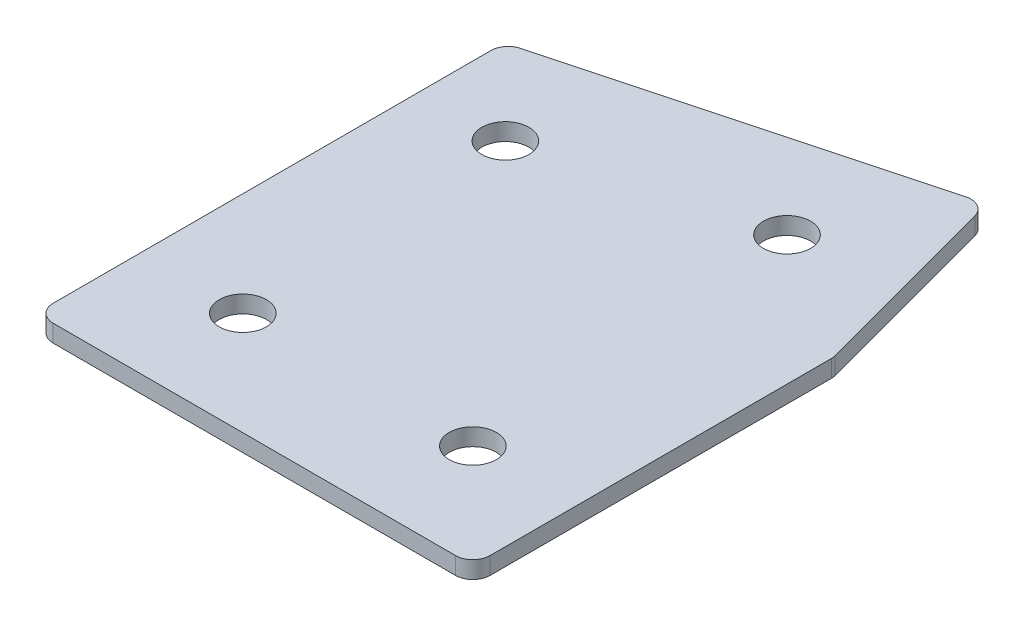
ISO-10303-21;
HEADER;
FILE_DESCRIPTION(('STEP AP214'),'2;1');
FILE_NAME('part.step','',(''),(''),'','','');
FILE_SCHEMA(('AUTOMOTIVE_DESIGN { 1 0 10303 214 1 1 1 1 }'));
ENDSEC;
DATA;
#1=APPLICATION_CONTEXT('core data for automotive mechanical design processes');
#2=APPLICATION_PROTOCOL_DEFINITION('international standard','automotive_design',2000,#1);
#3=PRODUCT_CONTEXT('',#1,'mechanical');
#4=PRODUCT('Part','Part','',(#3));
#5=PRODUCT_RELATED_PRODUCT_CATEGORY('part','',(#4));
#6=PRODUCT_DEFINITION_FORMATION('','',#4);
#7=PRODUCT_DEFINITION_CONTEXT('part definition',#1,'design');
#8=PRODUCT_DEFINITION('design','',#6,#7);
#9=PRODUCT_DEFINITION_SHAPE('','',#8);
#10=(LENGTH_UNIT() NAMED_UNIT(*) SI_UNIT(.MILLI.,.METRE.));
#11=(NAMED_UNIT(*) PLANE_ANGLE_UNIT() SI_UNIT($,.RADIAN.));
#12=(NAMED_UNIT(*) SI_UNIT($,.STERADIAN.) SOLID_ANGLE_UNIT());
#13=UNCERTAINTY_MEASURE_WITH_UNIT(LENGTH_MEASURE(1.E-05),#10,'distance_accuracy_value','');
#14=(GEOMETRIC_REPRESENTATION_CONTEXT(3) GLOBAL_UNCERTAINTY_ASSIGNED_CONTEXT((#13)) GLOBAL_UNIT_ASSIGNED_CONTEXT((#10,
#11,#12)) REPRESENTATION_CONTEXT('',''));
#15=CARTESIAN_POINT('',(0.,0.,0.));
#16=DIRECTION('',(0.,0.,1.));
#17=DIRECTION('',(1.,0.,0.));
#18=AXIS2_PLACEMENT_3D('',#15,#16,#17);
#19=CARTESIAN_POINT('',(0.,0.,0.));
#20=DIRECTION('',(0.,1.,0.));
#21=DIRECTION('',(0.,0.,1.));
#22=AXIS2_PLACEMENT_3D('',#19,#20,#21);
#23=PLANE('',#22);
#24=CARTESIAN_POINT('',(80.,0.,0.));
#25=DIRECTION('',(0.,1.,0.));
#26=DIRECTION('',(0.,0.,1.));
#27=AXIS2_PLACEMENT_3D('',#24,#25,#26);
#28=CIRCLE('',#27,4.09999999999999);
#29=CARTESIAN_POINT('',(80.,0.,4.09999999999999));
#30=VERTEX_POINT('',#29);
#31=EDGE_CURVE('E201',#30,#30,#28,.T.);
#32=ORIENTED_EDGE('',*,*,#31,.T.);
#33=EDGE_LOOP('',(#32));
#34=FACE_BOUND('',#33,.T.);
#35=CARTESIAN_POINT('',(75.5051025721683,0.,-59.1421356237311));
#36=DIRECTION('',(0.,1.,0.));
#37=DIRECTION('',(0.,0.,1.));
#38=AXIS2_PLACEMENT_3D('',#35,#36,#37);
#39=CIRCLE('',#38,4.1);
#40=CARTESIAN_POINT('',(75.5051025721683,0.,-55.0421356237311));
#41=VERTEX_POINT('',#40);
#42=EDGE_CURVE('E195',#41,#41,#39,.T.);
#43=ORIENTED_EDGE('',*,*,#42,.T.);
#44=EDGE_LOOP('',(#43));
#45=FACE_BOUND('',#44,.T.);
#46=CARTESIAN_POINT('',(36.8680695206055,0.,-48.7893738196305));
#47=DIRECTION('',(0.,1.,0.));
#48=DIRECTION('',(0.,0.,1.));
#49=AXIS2_PLACEMENT_3D('',#46,#47,#48);
#50=CIRCLE('',#49,4.1);
#51=CARTESIAN_POINT('',(36.8680695206055,0.,-44.6893738196305));
#52=VERTEX_POINT('',#51);
#53=EDGE_CURVE('E189',#52,#52,#50,.T.);
#54=ORIENTED_EDGE('',*,*,#53,.T.);
#55=EDGE_LOOP('',(#54));
#56=FACE_BOUND('',#55,.T.);
#57=CARTESIAN_POINT('',(40.,0.,0.));
#58=DIRECTION('',(0.,1.,0.));
#59=DIRECTION('',(0.,0.,1.));
#60=AXIS2_PLACEMENT_3D('',#57,#58,#59);
#61=CIRCLE('',#60,4.1);
#62=CARTESIAN_POINT('',(40.,0.,4.10000000000001));
#63=VERTEX_POINT('',#62);
#64=EDGE_CURVE('E115',#63,#63,#61,.T.);
#65=ORIENTED_EDGE('',*,*,#64,.T.);
#66=EDGE_LOOP('',(#65));
#67=FACE_BOUND('',#66,.T.);
#68=DIRECTION('',(0.,0.,1.));
#69=VECTOR('',#68,1.);
#70=CARTESIAN_POINT('',(22.0000000000001,0.,-63.440457845956));
#71=LINE('',#70,#69);
#72=CARTESIAN_POINT('',(22.0000000000001,0.,-61.1384768820191));
#73=VERTEX_POINT('',#72);
#74=CARTESIAN_POINT('',(22.,0.,14.9999999999999));
#75=VERTEX_POINT('',#74);
#76=EDGE_CURVE('E182',#73,#75,#71,.T.);
#77=ORIENTED_EDGE('',*,*,#76,.F.);
#78=CARTESIAN_POINT('',(25.0000000000001,0.,-61.1384768820191));
#79=DIRECTION('',(0.,1.,0.));
#80=DIRECTION('',(0.,0.,1.));
#81=AXIS2_PLACEMENT_3D('',#78,#79,#80);
#82=CIRCLE('',#81,3.);
#83=CARTESIAN_POINT('',(24.2235428646926,0.,-64.0362543608864));
#84=VERTEX_POINT('',#83);
#85=EDGE_CURVE('E146',#73,#84,#82,.F.);
#86=ORIENTED_EDGE('',*,*,#85,.T.);
#87=DIRECTION('',(-0.96592582628907,0.,0.258819045102515));
#88=VECTOR('',#87,1.);
#89=CARTESIAN_POINT('',(88.2330246335262,0.,-81.1875433087796));
#90=LINE('',#89,#88);
#91=CARTESIAN_POINT('',(85.335247154659,0.,-80.411086173472));
#92=VERTEX_POINT('',#91);
#93=EDGE_CURVE('E174',#92,#84,#90,.T.);
#94=ORIENTED_EDGE('',*,*,#93,.F.);
#95=CARTESIAN_POINT('',(86.1117042899665,0.,-77.5133086946048));
#96=DIRECTION('',(0.,1.,0.));
#97=DIRECTION('',(0.,0.,1.));
#98=AXIS2_PLACEMENT_3D('',#95,#96,#97);
#99=CIRCLE('',#98,3.);
#100=CARTESIAN_POINT('',(89.0094817688337,0.,-78.2897658299124));
#101=VERTEX_POINT('',#100);
#102=EDGE_CURVE('E118',#92,#101,#99,.F.);
#103=ORIENTED_EDGE('',*,*,#102,.T.);
#104=DIRECTION('',(-0.258819045102522,0.,-0.965925826289068));
#105=VECTOR('',#104,1.);
#106=CARTESIAN_POINT('',(98.0000000000002,0.,-44.7366950048252));
#107=LINE('',#106,#105);
#108=CARTESIAN_POINT('',(97.8977774788674,0.,-45.1181946473706));
#109=VERTEX_POINT('',#108);
#110=EDGE_CURVE('E119',#109,#101,#107,.T.);
#111=ORIENTED_EDGE('',*,*,#110,.F.);
#112=CARTESIAN_POINT('',(95.0000000000002,0.,-44.341737512063));
#113=DIRECTION('',(0.,1.,0.));
#114=DIRECTION('',(0.,0.,1.));
#115=AXIS2_PLACEMENT_3D('',#112,#113,#114);
#116=CIRCLE('',#115,3.);
#117=CARTESIAN_POINT('',(98.0000000000002,0.,-44.341737512063));
#118=VERTEX_POINT('',#117);
#119=EDGE_CURVE('E141',#109,#118,#116,.F.);
#120=ORIENTED_EDGE('',*,*,#119,.T.);
#121=DIRECTION('',(0.,0.,-1.));
#122=VECTOR('',#121,1.);
#123=CARTESIAN_POINT('',(98.,0.,18.));
#124=LINE('',#123,#122);
#125=CARTESIAN_POINT('',(98.,0.,15.));
#126=VERTEX_POINT('',#125);
#127=EDGE_CURVE('E123',#126,#118,#124,.T.);
#128=ORIENTED_EDGE('',*,*,#127,.F.);
#129=CARTESIAN_POINT('',(95.,0.,15.));
#130=DIRECTION('',(0.,1.,0.));
#131=DIRECTION('',(0.,0.,1.));
#132=AXIS2_PLACEMENT_3D('',#129,#130,#131);
#133=CIRCLE('',#132,3.);
#134=CARTESIAN_POINT('',(95.,0.,18.));
#135=VERTEX_POINT('',#134);
#136=EDGE_CURVE('E31',#126,#135,#133,.F.);
#137=ORIENTED_EDGE('',*,*,#136,.T.);
#138=DIRECTION('',(1.,0.,0.));
#139=VECTOR('',#138,1.);
#140=CARTESIAN_POINT('',(22.,0.,18.));
#141=LINE('',#140,#139);
#142=CARTESIAN_POINT('',(25.,0.,18.));
#143=VERTEX_POINT('',#142);
#144=EDGE_CURVE('E180',#143,#135,#141,.T.);
#145=ORIENTED_EDGE('',*,*,#144,.F.);
#146=CARTESIAN_POINT('',(25.,0.,15.));
#147=DIRECTION('',(0.,1.,0.));
#148=DIRECTION('',(0.,0.,1.));
#149=AXIS2_PLACEMENT_3D('',#146,#147,#148);
#150=CIRCLE('',#149,3.);
#151=EDGE_CURVE('E144',#143,#75,#150,.F.);
#152=ORIENTED_EDGE('',*,*,#151,.T.);
#153=EDGE_LOOP('',(#77,#86,#94,#103,#111,#120,#128,#137,#145,#152));
#154=FACE_BOUND('',#153,.T.);
#155=ADVANCED_FACE('F16',(#34,#45,#56,#67,#154),#23,.F.);
#156=CARTESIAN_POINT('',(88.2330246335262,0.,-81.1875433087796));
#157=DIRECTION('',(-0.258819045102515,0.,-0.96592582628907));
#158=DIRECTION('',(-0.96592582628907,0.,0.258819045102515));
#159=AXIS2_PLACEMENT_3D('',#156,#157,#158);
#160=PLANE('',#159);
#161=ORIENTED_EDGE('',*,*,#93,.T.);
#162=DIRECTION('',(0.,1.,0.));
#163=VECTOR('',#162,1.);
#164=CARTESIAN_POINT('',(24.2235428646926,0.,-64.0362543608864));
#165=LINE('',#164,#163);
#166=CARTESIAN_POINT('',(24.2235428646926,3.,-64.0362543608864));
#167=VERTEX_POINT('',#166);
#168=EDGE_CURVE('E105',#84,#167,#165,.T.);
#169=ORIENTED_EDGE('',*,*,#168,.T.);
#170=DIRECTION('',(-0.96592582628907,0.,0.258819045102515));
#171=VECTOR('',#170,1.);
#172=CARTESIAN_POINT('',(88.2330246335262,3.,-81.1875433087796));
#173=LINE('',#172,#171);
#174=CARTESIAN_POINT('',(85.335247154659,3.,-80.411086173472));
#175=VERTEX_POINT('',#174);
#176=EDGE_CURVE('E97',#175,#167,#173,.T.);
#177=ORIENTED_EDGE('',*,*,#176,.F.);
#178=DIRECTION('',(0.,1.,0.));
#179=VECTOR('',#178,1.);
#180=CARTESIAN_POINT('',(85.335247154659,0.,-80.411086173472));
#181=LINE('',#180,#179);
#182=EDGE_CURVE('E111',#175,#92,#181,.F.);
#183=ORIENTED_EDGE('',*,*,#182,.T.);
#184=EDGE_LOOP('',(#161,#169,#177,#183));
#185=FACE_BOUND('',#184,.T.);
#186=ADVANCED_FACE('F110',(#185),#160,.T.);
#187=CARTESIAN_POINT('',(98.0000000000002,0.,-44.7366950048252));
#188=DIRECTION('',(0.965925826289068,0.,-0.258819045102522));
#189=DIRECTION('',(-0.258819045102522,0.,-0.965925826289068));
#190=AXIS2_PLACEMENT_3D('',#187,#188,#189);
#191=PLANE('',#190);
#192=DIRECTION('',(-0.258819045102522,0.,-0.965925826289068));
#193=VECTOR('',#192,1.);
#194=CARTESIAN_POINT('',(98.0000000000002,3.,-44.7366950048252));
#195=LINE('',#194,#193);
#196=CARTESIAN_POINT('',(97.8977774788674,3.,-45.1181946473706));
#197=VERTEX_POINT('',#196);
#198=CARTESIAN_POINT('',(89.0094817688337,3.,-78.2897658299124));
#199=VERTEX_POINT('',#198);
#200=EDGE_CURVE('E99',#197,#199,#195,.T.);
#201=ORIENTED_EDGE('',*,*,#200,.F.);
#202=DIRECTION('',(0.,1.,0.));
#203=VECTOR('',#202,1.);
#204=CARTESIAN_POINT('',(97.8977774788674,0.,-45.1181946473706));
#205=LINE('',#204,#203);
#206=EDGE_CURVE('E10',#197,#109,#205,.F.);
#207=ORIENTED_EDGE('',*,*,#206,.T.);
#208=ORIENTED_EDGE('',*,*,#110,.T.);
#209=DIRECTION('',(0.,1.,0.));
#210=VECTOR('',#209,1.);
#211=CARTESIAN_POINT('',(89.0094817688337,0.,-78.2897658299124));
#212=LINE('',#211,#210);
#213=EDGE_CURVE('E24',#101,#199,#212,.T.);
#214=ORIENTED_EDGE('',*,*,#213,.T.);
#215=EDGE_LOOP('',(#201,#207,#208,#214));
#216=FACE_BOUND('',#215,.T.);
#217=ADVANCED_FACE('F157',(#216),#191,.T.);
#218=CARTESIAN_POINT('',(98.,0.,18.));
#219=DIRECTION('',(1.,0.,0.));
#220=DIRECTION('',(0.,0.,-1.));
#221=AXIS2_PLACEMENT_3D('',#218,#219,#220);
#222=PLANE('',#221);
#223=DIRECTION('',(0.,0.,-1.));
#224=VECTOR('',#223,1.);
#225=CARTESIAN_POINT('',(98.,3.,18.));
#226=LINE('',#225,#224);
#227=CARTESIAN_POINT('',(98.,3.,15.));
#228=VERTEX_POINT('',#227);
#229=CARTESIAN_POINT('',(98.0000000000002,3.,-44.341737512063));
#230=VERTEX_POINT('',#229);
#231=EDGE_CURVE('E170',#228,#230,#226,.T.);
#232=ORIENTED_EDGE('',*,*,#231,.F.);
#233=DIRECTION('',(0.,1.,0.));
#234=VECTOR('',#233,1.);
#235=CARTESIAN_POINT('',(98.,0.,15.));
#236=LINE('',#235,#234);
#237=EDGE_CURVE('E155',#228,#126,#236,.F.);
#238=ORIENTED_EDGE('',*,*,#237,.T.);
#239=ORIENTED_EDGE('',*,*,#127,.T.);
#240=DIRECTION('',(0.,1.,0.));
#241=VECTOR('',#240,1.);
#242=CARTESIAN_POINT('',(98.0000000000002,0.,-44.341737512063));
#243=LINE('',#242,#241);
#244=EDGE_CURVE('E152',#118,#230,#243,.T.);
#245=ORIENTED_EDGE('',*,*,#244,.T.);
#246=EDGE_LOOP('',(#232,#238,#239,#245));
#247=FACE_BOUND('',#246,.T.);
#248=ADVANCED_FACE('F169',(#247),#222,.T.);
#249=CARTESIAN_POINT('',(22.,0.,18.));
#250=DIRECTION('',(0.,0.,1.));
#251=DIRECTION('',(1.,0.,0.));
#252=AXIS2_PLACEMENT_3D('',#249,#250,#251);
#253=PLANE('',#252);
#254=DIRECTION('',(1.,0.,0.));
#255=VECTOR('',#254,1.);
#256=CARTESIAN_POINT('',(22.,3.,18.));
#257=LINE('',#256,#255);
#258=CARTESIAN_POINT('',(25.,3.,18.));
#259=VERTEX_POINT('',#258);
#260=CARTESIAN_POINT('',(95.,3.,18.));
#261=VERTEX_POINT('',#260);
#262=EDGE_CURVE('E173',#259,#261,#257,.T.);
#263=ORIENTED_EDGE('',*,*,#262,.F.);
#264=DIRECTION('',(0.,1.,0.));
#265=VECTOR('',#264,1.);
#266=CARTESIAN_POINT('',(25.,0.,18.));
#267=LINE('',#266,#265);
#268=EDGE_CURVE('E38',#259,#143,#267,.F.);
#269=ORIENTED_EDGE('',*,*,#268,.T.);
#270=ORIENTED_EDGE('',*,*,#144,.T.);
#271=DIRECTION('',(0.,1.,0.));
#272=VECTOR('',#271,1.);
#273=CARTESIAN_POINT('',(95.,0.,18.));
#274=LINE('',#273,#272);
#275=EDGE_CURVE('E148',#135,#261,#274,.T.);
#276=ORIENTED_EDGE('',*,*,#275,.T.);
#277=EDGE_LOOP('',(#263,#269,#270,#276));
#278=FACE_BOUND('',#277,.T.);
#279=ADVANCED_FACE('F337',(#278),#253,.T.);
#280=CARTESIAN_POINT('',(22.0000000000001,0.,-63.440457845956));
#281=DIRECTION('',(-1.,0.,0.));
#282=DIRECTION('',(0.,0.,1.));
#283=AXIS2_PLACEMENT_3D('',#280,#281,#282);
#284=PLANE('',#283);
#285=DIRECTION('',(0.,0.,1.));
#286=VECTOR('',#285,1.);
#287=CARTESIAN_POINT('',(22.0000000000001,3.,-63.440457845956));
#288=LINE('',#287,#286);
#289=CARTESIAN_POINT('',(22.0000000000001,3.,-61.1384768820191));
#290=VERTEX_POINT('',#289);
#291=CARTESIAN_POINT('',(22.,3.,14.9999999999999));
#292=VERTEX_POINT('',#291);
#293=EDGE_CURVE('E114',#290,#292,#288,.T.);
#294=ORIENTED_EDGE('',*,*,#293,.F.);
#295=DIRECTION('',(0.,1.,0.));
#296=VECTOR('',#295,1.);
#297=CARTESIAN_POINT('',(22.0000000000001,0.,-61.1384768820191));
#298=LINE('',#297,#296);
#299=EDGE_CURVE('E138',#290,#73,#298,.F.);
#300=ORIENTED_EDGE('',*,*,#299,.T.);
#301=ORIENTED_EDGE('',*,*,#76,.T.);
#302=DIRECTION('',(0.,1.,0.));
#303=VECTOR('',#302,1.);
#304=CARTESIAN_POINT('',(22.,0.,15.));
#305=LINE('',#304,#303);
#306=EDGE_CURVE('E135',#75,#292,#305,.T.);
#307=ORIENTED_EDGE('',*,*,#306,.T.);
#308=EDGE_LOOP('',(#294,#300,#301,#307));
#309=FACE_BOUND('',#308,.T.);
#310=ADVANCED_FACE('F223',(#309),#284,.T.);
#311=CARTESIAN_POINT('',(0.,3.,0.));
#312=DIRECTION('',(0.,1.,0.));
#313=DIRECTION('',(0.,0.,1.));
#314=AXIS2_PLACEMENT_3D('',#311,#312,#313);
#315=PLANE('',#314);
#316=CARTESIAN_POINT('',(80.,3.,0.));
#317=DIRECTION('',(0.,1.,0.));
#318=DIRECTION('',(0.,0.,1.));
#319=AXIS2_PLACEMENT_3D('',#316,#317,#318);
#320=CIRCLE('',#319,4.09999999999999);
#321=CARTESIAN_POINT('',(80.,3.,4.09999999999999));
#322=VERTEX_POINT('',#321);
#323=EDGE_CURVE('E204',#322,#322,#320,.T.);
#324=ORIENTED_EDGE('',*,*,#323,.F.);
#325=EDGE_LOOP('',(#324));
#326=FACE_BOUND('',#325,.T.);
#327=CARTESIAN_POINT('',(75.5051025721683,3.,-59.1421356237311));
#328=DIRECTION('',(0.,1.,0.));
#329=DIRECTION('',(0.,0.,1.));
#330=AXIS2_PLACEMENT_3D('',#327,#328,#329);
#331=CIRCLE('',#330,4.1);
#332=CARTESIAN_POINT('',(75.5051025721683,3.,-55.0421356237311));
#333=VERTEX_POINT('',#332);
#334=EDGE_CURVE('E198',#333,#333,#331,.T.);
#335=ORIENTED_EDGE('',*,*,#334,.F.);
#336=EDGE_LOOP('',(#335));
#337=FACE_BOUND('',#336,.T.);
#338=CARTESIAN_POINT('',(36.8680695206055,3.,-48.7893738196305));
#339=DIRECTION('',(0.,1.,0.));
#340=DIRECTION('',(0.,0.,1.));
#341=AXIS2_PLACEMENT_3D('',#338,#339,#340);
#342=CIRCLE('',#341,4.1);
#343=CARTESIAN_POINT('',(36.8680695206055,3.,-44.6893738196305));
#344=VERTEX_POINT('',#343);
#345=EDGE_CURVE('E192',#344,#344,#342,.T.);
#346=ORIENTED_EDGE('',*,*,#345,.F.);
#347=EDGE_LOOP('',(#346));
#348=FACE_BOUND('',#347,.T.);
#349=CARTESIAN_POINT('',(40.,3.,0.));
#350=DIRECTION('',(0.,1.,0.));
#351=DIRECTION('',(0.,0.,1.));
#352=AXIS2_PLACEMENT_3D('',#349,#350,#351);
#353=CIRCLE('',#352,4.1);
#354=CARTESIAN_POINT('',(40.,3.,4.10000000000001));
#355=VERTEX_POINT('',#354);
#356=EDGE_CURVE('E186',#355,#355,#353,.T.);
#357=ORIENTED_EDGE('',*,*,#356,.F.);
#358=EDGE_LOOP('',(#357));
#359=FACE_BOUND('',#358,.T.);
#360=ORIENTED_EDGE('',*,*,#176,.T.);
#361=CARTESIAN_POINT('',(25.0000000000001,3.,-61.1384768820191));
#362=DIRECTION('',(0.,1.,0.));
#363=DIRECTION('',(0.,0.,1.));
#364=AXIS2_PLACEMENT_3D('',#361,#362,#363);
#365=CIRCLE('',#364,3.);
#366=EDGE_CURVE('E133',#167,#290,#365,.T.);
#367=ORIENTED_EDGE('',*,*,#366,.T.);
#368=ORIENTED_EDGE('',*,*,#293,.T.);
#369=CARTESIAN_POINT('',(25.,3.,15.));
#370=DIRECTION('',(0.,1.,0.));
#371=DIRECTION('',(0.,0.,1.));
#372=AXIS2_PLACEMENT_3D('',#369,#370,#371);
#373=CIRCLE('',#372,3.);
#374=EDGE_CURVE('E131',#292,#259,#373,.T.);
#375=ORIENTED_EDGE('',*,*,#374,.T.);
#376=ORIENTED_EDGE('',*,*,#262,.T.);
#377=CARTESIAN_POINT('',(95.,3.,15.));
#378=DIRECTION('',(0.,1.,0.));
#379=DIRECTION('',(0.,0.,1.));
#380=AXIS2_PLACEMENT_3D('',#377,#378,#379);
#381=CIRCLE('',#380,3.);
#382=EDGE_CURVE('E129',#261,#228,#381,.T.);
#383=ORIENTED_EDGE('',*,*,#382,.T.);
#384=ORIENTED_EDGE('',*,*,#231,.T.);
#385=CARTESIAN_POINT('',(95.0000000000002,3.,-44.341737512063));
#386=DIRECTION('',(0.,1.,0.));
#387=DIRECTION('',(0.,0.,1.));
#388=AXIS2_PLACEMENT_3D('',#385,#386,#387);
#389=CIRCLE('',#388,3.);
#390=EDGE_CURVE('E104',#230,#197,#389,.T.);
#391=ORIENTED_EDGE('',*,*,#390,.T.);
#392=ORIENTED_EDGE('',*,*,#200,.T.);
#393=CARTESIAN_POINT('',(86.1117042899665,3.,-77.5133086946048));
#394=DIRECTION('',(0.,1.,0.));
#395=DIRECTION('',(0.,0.,1.));
#396=AXIS2_PLACEMENT_3D('',#393,#394,#395);
#397=CIRCLE('',#396,3.);
#398=EDGE_CURVE('E94',#199,#175,#397,.T.);
#399=ORIENTED_EDGE('',*,*,#398,.T.);
#400=EDGE_LOOP('',(#360,#367,#368,#375,#376,#383,#384,#391,#392,#399));
#401=FACE_BOUND('',#400,.T.);
#402=ADVANCED_FACE('F96',(#326,#337,#348,#359,#401),#315,.T.);
#403=CARTESIAN_POINT('',(40.,0.,0.));
#404=DIRECTION('',(0.,1.,0.));
#405=DIRECTION('',(0.,0.,1.));
#406=AXIS2_PLACEMENT_3D('',#403,#404,#405);
#407=CYLINDRICAL_SURFACE('',#406,4.1);
#408=ORIENTED_EDGE('',*,*,#64,.F.);
#409=EDGE_LOOP('',(#408));
#410=FACE_BOUND('',#409,.T.);
#411=ORIENTED_EDGE('',*,*,#356,.T.);
#412=EDGE_LOOP('',(#411));
#413=FACE_BOUND('',#412,.T.);
#414=ADVANCED_FACE('F222',(#410,#413),#407,.F.);
#415=CARTESIAN_POINT('',(36.8680695206055,0.,-48.7893738196305));
#416=DIRECTION('',(0.,1.,0.));
#417=DIRECTION('',(0.,0.,1.));
#418=AXIS2_PLACEMENT_3D('',#415,#416,#417);
#419=CYLINDRICAL_SURFACE('',#418,4.1);
#420=ORIENTED_EDGE('',*,*,#53,.F.);
#421=EDGE_LOOP('',(#420));
#422=FACE_BOUND('',#421,.T.);
#423=ORIENTED_EDGE('',*,*,#345,.T.);
#424=EDGE_LOOP('',(#423));
#425=FACE_BOUND('',#424,.T.);
#426=ADVANCED_FACE('F232',(#422,#425),#419,.F.);
#427=CARTESIAN_POINT('',(75.5051025721683,0.,-59.1421356237311));
#428=DIRECTION('',(0.,1.,0.));
#429=DIRECTION('',(0.,0.,1.));
#430=AXIS2_PLACEMENT_3D('',#427,#428,#429);
#431=CYLINDRICAL_SURFACE('',#430,4.1);
#432=ORIENTED_EDGE('',*,*,#42,.F.);
#433=EDGE_LOOP('',(#432));
#434=FACE_BOUND('',#433,.T.);
#435=ORIENTED_EDGE('',*,*,#334,.T.);
#436=EDGE_LOOP('',(#435));
#437=FACE_BOUND('',#436,.T.);
#438=ADVANCED_FACE('F216',(#434,#437),#431,.F.);
#439=CARTESIAN_POINT('',(80.,0.,0.));
#440=DIRECTION('',(0.,1.,0.));
#441=DIRECTION('',(0.,0.,1.));
#442=AXIS2_PLACEMENT_3D('',#439,#440,#441);
#443=CYLINDRICAL_SURFACE('',#442,4.09999999999999);
#444=ORIENTED_EDGE('',*,*,#31,.F.);
#445=EDGE_LOOP('',(#444));
#446=FACE_BOUND('',#445,.T.);
#447=ORIENTED_EDGE('',*,*,#323,.T.);
#448=EDGE_LOOP('',(#447));
#449=FACE_BOUND('',#448,.T.);
#450=ADVANCED_FACE('F212',(#446,#449),#443,.F.);
#451=CARTESIAN_POINT('',(25.0000000000001,0.,-61.1384768820191));
#452=DIRECTION('',(0.,1.,0.));
#453=DIRECTION('',(0.,0.,1.));
#454=AXIS2_PLACEMENT_3D('',#451,#452,#453);
#455=CYLINDRICAL_SURFACE('',#454,3.);
#456=ORIENTED_EDGE('',*,*,#85,.F.);
#457=ORIENTED_EDGE('',*,*,#299,.F.);
#458=ORIENTED_EDGE('',*,*,#366,.F.);
#459=ORIENTED_EDGE('',*,*,#168,.F.);
#460=EDGE_LOOP('',(#456,#457,#458,#459));
#461=FACE_BOUND('',#460,.T.);
#462=ADVANCED_FACE('F215',(#461),#455,.T.);
#463=CARTESIAN_POINT('',(25.,0.,15.));
#464=DIRECTION('',(0.,1.,0.));
#465=DIRECTION('',(0.,0.,1.));
#466=AXIS2_PLACEMENT_3D('',#463,#464,#465);
#467=CYLINDRICAL_SURFACE('',#466,3.);
#468=ORIENTED_EDGE('',*,*,#151,.F.);
#469=ORIENTED_EDGE('',*,*,#268,.F.);
#470=ORIENTED_EDGE('',*,*,#374,.F.);
#471=ORIENTED_EDGE('',*,*,#306,.F.);
#472=EDGE_LOOP('',(#468,#469,#470,#471));
#473=FACE_BOUND('',#472,.T.);
#474=ADVANCED_FACE('F252',(#473),#467,.T.);
#475=CARTESIAN_POINT('',(95.,0.,15.));
#476=DIRECTION('',(0.,1.,0.));
#477=DIRECTION('',(0.,0.,1.));
#478=AXIS2_PLACEMENT_3D('',#475,#476,#477);
#479=CYLINDRICAL_SURFACE('',#478,3.);
#480=ORIENTED_EDGE('',*,*,#136,.F.);
#481=ORIENTED_EDGE('',*,*,#237,.F.);
#482=ORIENTED_EDGE('',*,*,#382,.F.);
#483=ORIENTED_EDGE('',*,*,#275,.F.);
#484=EDGE_LOOP('',(#480,#481,#482,#483));
#485=FACE_BOUND('',#484,.T.);
#486=ADVANCED_FACE('F256',(#485),#479,.T.);
#487=CARTESIAN_POINT('',(95.0000000000002,0.,-44.341737512063));
#488=DIRECTION('',(0.,1.,0.));
#489=DIRECTION('',(0.,0.,1.));
#490=AXIS2_PLACEMENT_3D('',#487,#488,#489);
#491=CYLINDRICAL_SURFACE('',#490,3.);
#492=ORIENTED_EDGE('',*,*,#119,.F.);
#493=ORIENTED_EDGE('',*,*,#206,.F.);
#494=ORIENTED_EDGE('',*,*,#390,.F.);
#495=ORIENTED_EDGE('',*,*,#244,.F.);
#496=EDGE_LOOP('',(#492,#493,#494,#495));
#497=FACE_BOUND('',#496,.T.);
#498=ADVANCED_FACE('F165',(#497),#491,.T.);
#499=CARTESIAN_POINT('',(86.1117042899665,0.,-77.5133086946048));
#500=DIRECTION('',(0.,1.,0.));
#501=DIRECTION('',(0.,0.,1.));
#502=AXIS2_PLACEMENT_3D('',#499,#500,#501);
#503=CYLINDRICAL_SURFACE('',#502,3.);
#504=ORIENTED_EDGE('',*,*,#102,.F.);
#505=ORIENTED_EDGE('',*,*,#182,.F.);
#506=ORIENTED_EDGE('',*,*,#398,.F.);
#507=ORIENTED_EDGE('',*,*,#213,.F.);
#508=EDGE_LOOP('',(#504,#505,#506,#507));
#509=FACE_BOUND('',#508,.T.);
#510=ADVANCED_FACE('F18',(#509),#503,.T.);
#511=CLOSED_SHELL('',(#155,#186,#217,#248,#279,#310,#402,#414,#426,#438,#450,#462,#474,#486,
#498,#510));
#512=MANIFOLD_SOLID_BREP('B1',#511);
#513=ADVANCED_BREP_SHAPE_REPRESENTATION('',(#18,#512),#14);
#514=SHAPE_DEFINITION_REPRESENTATION(#9,#513);
ENDSEC;
END-ISO-10303-21;
